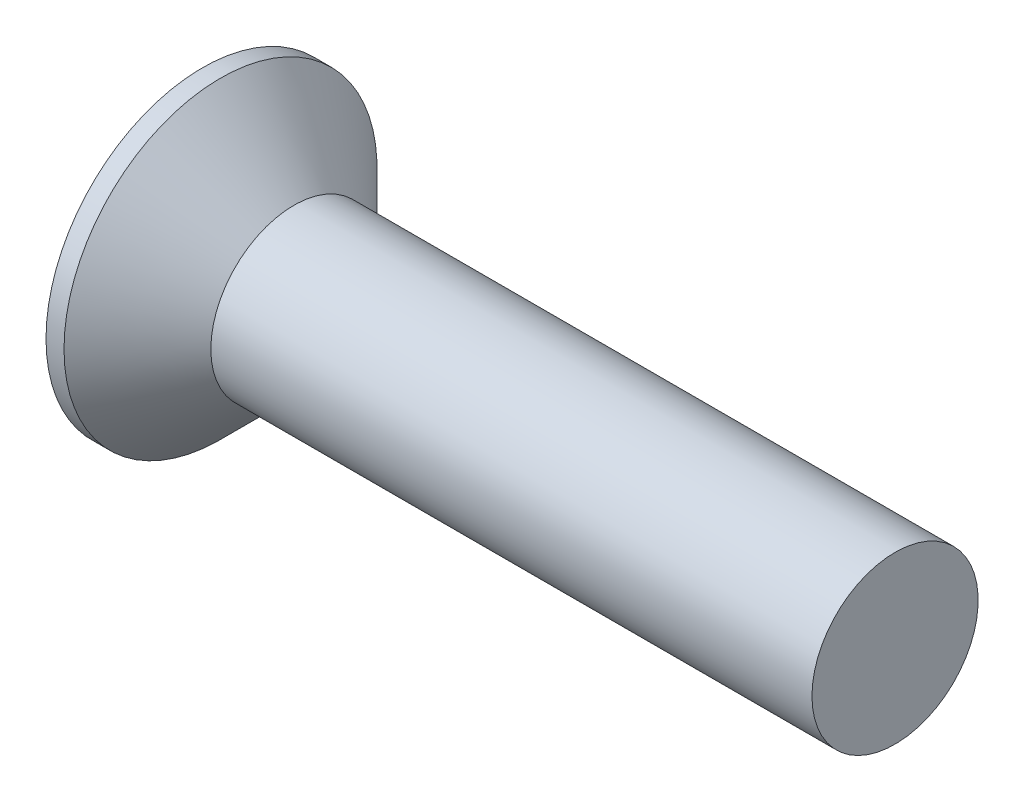
ISO-10303-21;
HEADER;
FILE_DESCRIPTION(('STEP AP214'),'2;1');
FILE_NAME('part.step','',(''),(''),'','','');
FILE_SCHEMA(('AUTOMOTIVE_DESIGN { 1 0 10303 214 1 1 1 1 }'));
ENDSEC;
DATA;
#1=APPLICATION_CONTEXT('core data for automotive mechanical design processes');
#2=APPLICATION_PROTOCOL_DEFINITION('international standard','automotive_design',2000,#1);
#3=PRODUCT_CONTEXT('',#1,'mechanical');
#4=PRODUCT('Part','Part','',(#3));
#5=PRODUCT_RELATED_PRODUCT_CATEGORY('part','',(#4));
#6=PRODUCT_DEFINITION_FORMATION('','',#4);
#7=PRODUCT_DEFINITION_CONTEXT('part definition',#1,'design');
#8=PRODUCT_DEFINITION('design','',#6,#7);
#9=PRODUCT_DEFINITION_SHAPE('','',#8);
#10=(LENGTH_UNIT() NAMED_UNIT(*) SI_UNIT(.MILLI.,.METRE.));
#11=(NAMED_UNIT(*) PLANE_ANGLE_UNIT() SI_UNIT($,.RADIAN.));
#12=(NAMED_UNIT(*) SI_UNIT($,.STERADIAN.) SOLID_ANGLE_UNIT());
#13=UNCERTAINTY_MEASURE_WITH_UNIT(LENGTH_MEASURE(1.E-05),#10,'distance_accuracy_value','');
#14=(GEOMETRIC_REPRESENTATION_CONTEXT(3) GLOBAL_UNCERTAINTY_ASSIGNED_CONTEXT((#13)) GLOBAL_UNIT_ASSIGNED_CONTEXT((#10,
#11,#12)) REPRESENTATION_CONTEXT('',''));
#15=CARTESIAN_POINT('',(0.,0.,0.));
#16=DIRECTION('',(0.,0.,1.));
#17=DIRECTION('',(1.,0.,0.));
#18=AXIS2_PLACEMENT_3D('',#15,#16,#17);
#19=CARTESIAN_POINT('',(0.,0.,0.));
#20=DIRECTION('',(-1.,0.,0.));
#21=DIRECTION('',(0.,0.,1.));
#22=AXIS2_PLACEMENT_3D('',#19,#20,#21);
#23=PLANE('',#22);
#24=CARTESIAN_POINT('',(0.,0.,0.));
#25=DIRECTION('',(-1.,0.,0.));
#26=DIRECTION('',(0.,0.,1.));
#27=AXIS2_PLACEMENT_3D('',#24,#25,#26);
#28=CIRCLE('',#27,5.65);
#29=CARTESIAN_POINT('',(0.,0.,5.65));
#30=VERTEX_POINT('',#29);
#31=EDGE_CURVE('E129',#30,#30,#28,.T.);
#32=ORIENTED_EDGE('',*,*,#31,.T.);
#33=EDGE_LOOP('',(#32));
#34=FACE_BOUND('',#33,.T.);
#35=DIRECTION('',(0.,1.,0.));
#36=VECTOR('',#35,1.);
#37=CARTESIAN_POINT('',(0.,-3.31,-0.56));
#38=LINE('',#37,#36);
#39=CARTESIAN_POINT('',(0.,-3.31,-0.56));
#40=VERTEX_POINT('',#39);
#41=CARTESIAN_POINT('',(0.,-0.559999999999998,-0.56));
#42=VERTEX_POINT('',#41);
#43=EDGE_CURVE('E104',#40,#42,#38,.T.);
#44=ORIENTED_EDGE('',*,*,#43,.T.);
#45=DIRECTION('',(0.,0.,-1.));
#46=VECTOR('',#45,1.);
#47=CARTESIAN_POINT('',(0.,-0.560000000000011,3.31));
#48=LINE('',#47,#46);
#49=CARTESIAN_POINT('',(0.,-0.559999999999989,-3.31));
#50=VERTEX_POINT('',#49);
#51=EDGE_CURVE('E84',#42,#50,#48,.T.);
#52=ORIENTED_EDGE('',*,*,#51,.T.);
#53=DIRECTION('',(0.,1.,0.));
#54=VECTOR('',#53,1.);
#55=CARTESIAN_POINT('',(0.,-0.559999999999989,-3.31));
#56=LINE('',#55,#54);
#57=CARTESIAN_POINT('',(0.,0.560000000000012,-3.31));
#58=VERTEX_POINT('',#57);
#59=EDGE_CURVE('E329',#50,#58,#56,.T.);
#60=ORIENTED_EDGE('',*,*,#59,.T.);
#61=DIRECTION('',(0.,0.,1.));
#62=VECTOR('',#61,1.);
#63=CARTESIAN_POINT('',(0.,0.560000000000012,-3.31));
#64=LINE('',#63,#62);
#65=CARTESIAN_POINT('',(0.,0.560000000000002,-0.56));
#66=VERTEX_POINT('',#65);
#67=EDGE_CURVE('E100',#58,#66,#64,.T.);
#68=ORIENTED_EDGE('',*,*,#67,.T.);
#69=CARTESIAN_POINT('',(0.,3.31,-0.56));
#70=VERTEX_POINT('',#69);
#71=EDGE_CURVE('E94',#66,#70,#38,.T.);
#72=ORIENTED_EDGE('',*,*,#71,.T.);
#73=DIRECTION('',(0.,0.,1.));
#74=VECTOR('',#73,1.);
#75=CARTESIAN_POINT('',(0.,3.31,-0.56));
#76=LINE('',#75,#74);
#77=CARTESIAN_POINT('',(0.,3.31,0.56));
#78=VERTEX_POINT('',#77);
#79=EDGE_CURVE('E97',#70,#78,#76,.T.);
#80=ORIENTED_EDGE('',*,*,#79,.T.);
#81=DIRECTION('',(0.,-1.,0.));
#82=VECTOR('',#81,1.);
#83=CARTESIAN_POINT('',(0.,3.31,0.56));
#84=LINE('',#83,#82);
#85=CARTESIAN_POINT('',(0.,0.559999999999998,0.56));
#86=VERTEX_POINT('',#85);
#87=EDGE_CURVE('E321',#78,#86,#84,.T.);
#88=ORIENTED_EDGE('',*,*,#87,.T.);
#89=CARTESIAN_POINT('',(0.,0.559999999999988,3.31));
#90=VERTEX_POINT('',#89);
#91=EDGE_CURVE('E339',#86,#90,#64,.T.);
#92=ORIENTED_EDGE('',*,*,#91,.T.);
#93=DIRECTION('',(0.,-1.,0.));
#94=VECTOR('',#93,1.);
#95=CARTESIAN_POINT('',(0.,0.559999999999988,3.31));
#96=LINE('',#95,#94);
#97=CARTESIAN_POINT('',(0.,-0.560000000000011,3.31));
#98=VERTEX_POINT('',#97);
#99=EDGE_CURVE('E341',#90,#98,#96,.T.);
#100=ORIENTED_EDGE('',*,*,#99,.T.);
#101=CARTESIAN_POINT('',(0.,-0.560000000000002,0.56));
#102=VERTEX_POINT('',#101);
#103=EDGE_CURVE('E343',#98,#102,#48,.T.);
#104=ORIENTED_EDGE('',*,*,#103,.T.);
#105=CARTESIAN_POINT('',(0.,-3.31,0.56));
#106=VERTEX_POINT('',#105);
#107=EDGE_CURVE('E110',#102,#106,#84,.T.);
#108=ORIENTED_EDGE('',*,*,#107,.T.);
#109=DIRECTION('',(0.,0.,-1.));
#110=VECTOR('',#109,1.);
#111=CARTESIAN_POINT('',(0.,-3.31,0.56));
#112=LINE('',#111,#110);
#113=EDGE_CURVE('E133',#106,#40,#112,.T.);
#114=ORIENTED_EDGE('',*,*,#113,.T.);
#115=EDGE_LOOP('',(#44,#52,#60,#68,#72,#80,#88,#92,#100,#104,#108,#114));
#116=FACE_BOUND('',#115,.T.);
#117=ADVANCED_FACE('F35',(#34,#116),#23,.T.);
#118=CARTESIAN_POINT('',(3.94359735973597,0.,0.254125412541254));
#119=DIRECTION('',(-0.0773300701082969,0.,-0.9970055467534));
#120=DIRECTION('',(-0.9970055467534,0.,0.0773300701082969));
#121=AXIS2_PLACEMENT_3D('',#118,#119,#120);
#122=PLANE('',#121);
#123=ORIENTED_EDGE('',*,*,#107,.F.);
#124=DIRECTION('',(0.994037833653026,0.0770998873747502,-0.07709988737475));
#125=VECTOR('',#124,1.);
#126=CARTESIAN_POINT('',(3.96307358345415,-0.252614791311036,0.252614791311035));
#127=LINE('',#126,#125);
#128=CARTESIAN_POINT('',(3.61,-0.280000000000001,0.279999999999998));
#129=VERTEX_POINT('',#128);
#130=EDGE_CURVE('E128',#102,#129,#127,.T.);
#131=ORIENTED_EDGE('',*,*,#130,.T.);
#132=DIRECTION('',(0.764607457283212,0.641761937830508,-0.0593047335288919));
#133=VECTOR('',#132,1.);
#134=CARTESIAN_POINT('',(0.,-3.31,0.56));
#135=LINE('',#134,#133);
#136=EDGE_CURVE('E105',#106,#129,#135,.T.);
#137=ORIENTED_EDGE('',*,*,#136,.F.);
#138=EDGE_LOOP('',(#123,#131,#137));
#139=FACE_BOUND('',#138,.T.);
#140=ADVANCED_FACE('F153',(#139),#122,.T.);
#141=DIRECTION('',(0.764607457283212,-0.641761937830508,-0.0593047335288917));
#142=VECTOR('',#141,1.);
#143=CARTESIAN_POINT('',(0.,3.31,0.56));
#144=LINE('',#143,#142);
#145=CARTESIAN_POINT('',(3.61,0.279999999999999,0.28));
#146=VERTEX_POINT('',#145);
#147=EDGE_CURVE('E50',#78,#146,#144,.T.);
#148=ORIENTED_EDGE('',*,*,#147,.T.);
#149=DIRECTION('',(-0.994037833653026,0.0770998873747497,0.07709988737475));
#150=VECTOR('',#149,1.);
#151=CARTESIAN_POINT('',(3.96307358345415,0.252614791311034,0.252614791311035));
#152=LINE('',#151,#150);
#153=EDGE_CURVE('E325',#146,#86,#152,.T.);
#154=ORIENTED_EDGE('',*,*,#153,.T.);
#155=ORIENTED_EDGE('',*,*,#87,.F.);
#156=EDGE_LOOP('',(#148,#154,#155));
#157=FACE_BOUND('',#156,.T.);
#158=ADVANCED_FACE('F159',(#157),#122,.T.);
#159=CARTESIAN_POINT('',(3.94359735973597,0.,-0.254125412541254));
#160=DIRECTION('',(-0.0773300701082969,0.,0.9970055467534));
#161=DIRECTION('',(0.9970055467534,0.,0.0773300701082969));
#162=AXIS2_PLACEMENT_3D('',#159,#160,#161);
#163=PLANE('',#162);
#164=DIRECTION('',(0.764607457283212,0.641761937830508,0.0593047335288918));
#165=VECTOR('',#164,1.);
#166=CARTESIAN_POINT('',(0.,-3.31,-0.56));
#167=LINE('',#166,#165);
#168=CARTESIAN_POINT('',(3.61,-0.279999999999999,-0.280000000000001));
#169=VERTEX_POINT('',#168);
#170=EDGE_CURVE('E59',#40,#169,#167,.T.);
#171=ORIENTED_EDGE('',*,*,#170,.T.);
#172=DIRECTION('',(-0.994037833653026,-0.0770998873747497,-0.07709988737475));
#173=VECTOR('',#172,1.);
#174=CARTESIAN_POINT('',(3.96307358345415,-0.252614791311034,-0.252614791311035));
#175=LINE('',#174,#173);
#176=EDGE_CURVE('E11',#169,#42,#175,.T.);
#177=ORIENTED_EDGE('',*,*,#176,.T.);
#178=ORIENTED_EDGE('',*,*,#43,.F.);
#179=EDGE_LOOP('',(#171,#177,#178));
#180=FACE_BOUND('',#179,.T.);
#181=ADVANCED_FACE('F150',(#180),#163,.T.);
#182=ORIENTED_EDGE('',*,*,#71,.F.);
#183=DIRECTION('',(0.994037833653026,-0.0770998873747502,0.07709988737475));
#184=VECTOR('',#183,1.);
#185=CARTESIAN_POINT('',(3.96307358345415,0.252614791311036,-0.252614791311035));
#186=LINE('',#185,#184);
#187=CARTESIAN_POINT('',(3.61,0.28,-0.28));
#188=VERTEX_POINT('',#187);
#189=EDGE_CURVE('E113',#66,#188,#186,.T.);
#190=ORIENTED_EDGE('',*,*,#189,.T.);
#191=DIRECTION('',(0.764607457283212,-0.641761937830508,0.0593047335288918));
#192=VECTOR('',#191,1.);
#193=CARTESIAN_POINT('',(0.,3.31,-0.56));
#194=LINE('',#193,#192);
#195=EDGE_CURVE('E109',#70,#188,#194,.T.);
#196=ORIENTED_EDGE('',*,*,#195,.F.);
#197=EDGE_LOOP('',(#182,#190,#196));
#198=FACE_BOUND('',#197,.T.);
#199=ADVANCED_FACE('F112',(#198),#163,.T.);
#200=CARTESIAN_POINT('',(25.,3.,0.));
#201=DIRECTION('',(1.,0.,0.));
#202=DIRECTION('',(0.,0.,-1.));
#203=AXIS2_PLACEMENT_3D('',#200,#201,#202);
#204=PLANE('',#203);
#205=CARTESIAN_POINT('',(25.,0.,0.));
#206=DIRECTION('',(-1.,0.,0.));
#207=DIRECTION('',(0.,0.,1.));
#208=AXIS2_PLACEMENT_3D('',#205,#206,#207);
#209=CIRCLE('',#208,3.);
#210=CARTESIAN_POINT('',(25.,0.,3.));
#211=VERTEX_POINT('',#210);
#212=EDGE_CURVE('E43',#211,#211,#209,.T.);
#213=ORIENTED_EDGE('',*,*,#212,.F.);
#214=EDGE_LOOP('',(#213));
#215=FACE_BOUND('',#214,.T.);
#216=ADVANCED_FACE('F37',(#215),#204,.T.);
#217=CARTESIAN_POINT('',(-6.34999999999999,0.,0.));
#218=DIRECTION('',(-1.,0.,0.));
#219=DIRECTION('',(0.,0.,1.));
#220=AXIS2_PLACEMENT_3D('',#217,#218,#219);
#221=CYLINDRICAL_SURFACE('',#220,3.);
#222=ORIENTED_EDGE('',*,*,#212,.T.);
#223=EDGE_LOOP('',(#222));
#224=FACE_BOUND('',#223,.T.);
#225=CARTESIAN_POINT('',(3.3,0.,0.));
#226=DIRECTION('',(-1.,0.,0.));
#227=DIRECTION('',(0.,0.,1.));
#228=AXIS2_PLACEMENT_3D('',#225,#226,#227);
#229=CIRCLE('',#228,3.);
#230=CARTESIAN_POINT('',(3.3,0.,3.));
#231=VERTEX_POINT('',#230);
#232=EDGE_CURVE('E136',#231,#231,#229,.T.);
#233=ORIENTED_EDGE('',*,*,#232,.F.);
#234=EDGE_LOOP('',(#233));
#235=FACE_BOUND('',#234,.T.);
#236=ADVANCED_FACE('F141',(#224,#235),#221,.T.);
#237=CARTESIAN_POINT('',(0.65000000000001,0.,0.));
#238=DIRECTION('',(-1.,0.,0.));
#239=DIRECTION('',(0.,0.,1.));
#240=AXIS2_PLACEMENT_3D('',#237,#238,#239);
#241=CONICAL_SURFACE('',#240,5.65,0.78539816339745);
#242=ORIENTED_EDGE('',*,*,#232,.T.);
#243=EDGE_LOOP('',(#242));
#244=FACE_BOUND('',#243,.T.);
#245=CARTESIAN_POINT('',(0.65000000000001,0.,0.));
#246=DIRECTION('',(-1.,0.,0.));
#247=DIRECTION('',(0.,0.,1.));
#248=AXIS2_PLACEMENT_3D('',#245,#246,#247);
#249=CIRCLE('',#248,5.65);
#250=CARTESIAN_POINT('',(0.65000000000001,0.,5.65));
#251=VERTEX_POINT('',#250);
#252=EDGE_CURVE('E132',#251,#251,#249,.T.);
#253=ORIENTED_EDGE('',*,*,#252,.F.);
#254=EDGE_LOOP('',(#253));
#255=FACE_BOUND('',#254,.T.);
#256=ADVANCED_FACE('F149',(#244,#255),#241,.T.);
#257=CARTESIAN_POINT('',(-6.34999999999999,0.,0.));
#258=DIRECTION('',(-1.,0.,0.));
#259=DIRECTION('',(0.,0.,1.));
#260=AXIS2_PLACEMENT_3D('',#257,#258,#259);
#261=CYLINDRICAL_SURFACE('',#260,5.65);
#262=ORIENTED_EDGE('',*,*,#252,.T.);
#263=EDGE_LOOP('',(#262));
#264=FACE_BOUND('',#263,.T.);
#265=ORIENTED_EDGE('',*,*,#31,.F.);
#266=EDGE_LOOP('',(#265));
#267=FACE_BOUND('',#266,.T.);
#268=ADVANCED_FACE('F166',(#264,#267),#261,.T.);
#269=CARTESIAN_POINT('',(3.61,0.28,-0.28));
#270=DIRECTION('',(1.,0.,0.));
#271=DIRECTION('',(0.,0.,-1.));
#272=AXIS2_PLACEMENT_3D('',#269,#270,#271);
#273=PLANE('',#272);
#274=DIRECTION('',(0.,1.,0.));
#275=VECTOR('',#274,1.);
#276=CARTESIAN_POINT('',(3.61,-0.28,-0.28));
#277=LINE('',#276,#275);
#278=EDGE_CURVE('E124',#169,#188,#277,.T.);
#279=ORIENTED_EDGE('',*,*,#278,.F.);
#280=DIRECTION('',(0.,0.,-1.));
#281=VECTOR('',#280,1.);
#282=CARTESIAN_POINT('',(3.61,-0.28,0.28));
#283=LINE('',#282,#281);
#284=EDGE_CURVE('E115',#129,#169,#283,.T.);
#285=ORIENTED_EDGE('',*,*,#284,.F.);
#286=DIRECTION('',(0.,-1.,0.));
#287=VECTOR('',#286,1.);
#288=CARTESIAN_POINT('',(3.61,0.28,0.28));
#289=LINE('',#288,#287);
#290=EDGE_CURVE('E118',#146,#129,#289,.T.);
#291=ORIENTED_EDGE('',*,*,#290,.F.);
#292=DIRECTION('',(0.,0.,1.));
#293=VECTOR('',#292,1.);
#294=CARTESIAN_POINT('',(3.61,0.28,-0.28));
#295=LINE('',#294,#293);
#296=EDGE_CURVE('E122',#188,#146,#295,.T.);
#297=ORIENTED_EDGE('',*,*,#296,.F.);
#298=EDGE_LOOP('',(#279,#285,#291,#297));
#299=FACE_BOUND('',#298,.T.);
#300=ADVANCED_FACE('F164',(#299),#273,.F.);
#301=CARTESIAN_POINT('',(0.,-3.31,-0.56));
#302=DIRECTION('',(-0.642893478338491,0.765955596304274,0.));
#303=DIRECTION('',(-0.765955596304275,-0.642893478338491,0.));
#304=AXIS2_PLACEMENT_3D('',#301,#302,#303);
#305=PLANE('',#304);
#306=ORIENTED_EDGE('',*,*,#170,.F.);
#307=ORIENTED_EDGE('',*,*,#113,.F.);
#308=ORIENTED_EDGE('',*,*,#136,.T.);
#309=ORIENTED_EDGE('',*,*,#284,.T.);
#310=EDGE_LOOP('',(#306,#307,#308,#309));
#311=FACE_BOUND('',#310,.T.);
#312=ADVANCED_FACE('F192',(#311),#305,.T.);
#313=CARTESIAN_POINT('',(0.,3.31,0.559999999999999));
#314=DIRECTION('',(-0.642893478338491,-0.765955596304274,0.));
#315=DIRECTION('',(0.765955596304274,-0.642893478338491,0.));
#316=AXIS2_PLACEMENT_3D('',#313,#314,#315);
#317=PLANE('',#316);
#318=ORIENTED_EDGE('',*,*,#147,.F.);
#319=ORIENTED_EDGE('',*,*,#79,.F.);
#320=ORIENTED_EDGE('',*,*,#195,.T.);
#321=ORIENTED_EDGE('',*,*,#296,.T.);
#322=EDGE_LOOP('',(#318,#319,#320,#321));
#323=FACE_BOUND('',#322,.T.);
#324=ADVANCED_FACE('F108',(#323),#317,.T.);
#325=CARTESIAN_POINT('',(3.94359735973597,-0.254125412541254,0.));
#326=DIRECTION('',(-0.0773300701082969,0.9970055467534,0.));
#327=DIRECTION('',(-0.9970055467534,-0.0773300701082969,0.));
#328=AXIS2_PLACEMENT_3D('',#325,#326,#327);
#329=PLANE('',#328);
#330=DIRECTION('',(0.764607457283212,0.0593047335288896,0.641761937830508));
#331=VECTOR('',#330,1.);
#332=CARTESIAN_POINT('',(0.,-0.559999999999989,-3.31));
#333=LINE('',#332,#331);
#334=EDGE_CURVE('E336',#50,#169,#333,.T.);
#335=ORIENTED_EDGE('',*,*,#334,.F.);
#336=ORIENTED_EDGE('',*,*,#51,.F.);
#337=ORIENTED_EDGE('',*,*,#176,.F.);
#338=EDGE_LOOP('',(#335,#336,#337));
#339=FACE_BOUND('',#338,.T.);
#340=ADVANCED_FACE('F206',(#339),#329,.T.);
#341=CARTESIAN_POINT('',(3.94359735973597,0.254125412541254,0.));
#342=DIRECTION('',(-0.0773300701082969,-0.9970055467534,0.));
#343=DIRECTION('',(0.9970055467534,-0.0773300701082969,0.));
#344=AXIS2_PLACEMENT_3D('',#341,#342,#343);
#345=PLANE('',#344);
#346=ORIENTED_EDGE('',*,*,#67,.F.);
#347=DIRECTION('',(0.764607457283212,-0.059304733528894,0.641761937830507));
#348=VECTOR('',#347,1.);
#349=CARTESIAN_POINT('',(0.,0.560000000000012,-3.31));
#350=LINE('',#349,#348);
#351=EDGE_CURVE('E75',#58,#188,#350,.T.);
#352=ORIENTED_EDGE('',*,*,#351,.T.);
#353=ORIENTED_EDGE('',*,*,#189,.F.);
#354=EDGE_LOOP('',(#346,#352,#353));
#355=FACE_BOUND('',#354,.T.);
#356=ADVANCED_FACE('F212',(#355),#345,.T.);
#357=CARTESIAN_POINT('',(0.,0.560000000000011,-3.31));
#358=DIRECTION('',(-0.642893478338491,0.,0.765955596304274));
#359=DIRECTION('',(-0.765955596304275,0.,-0.642893478338491));
#360=AXIS2_PLACEMENT_3D('',#357,#358,#359);
#361=PLANE('',#360);
#362=ORIENTED_EDGE('',*,*,#351,.F.);
#363=ORIENTED_EDGE('',*,*,#59,.F.);
#364=ORIENTED_EDGE('',*,*,#334,.T.);
#365=ORIENTED_EDGE('',*,*,#278,.T.);
#366=EDGE_LOOP('',(#362,#363,#364,#365));
#367=FACE_BOUND('',#366,.T.);
#368=ADVANCED_FACE('F220',(#367),#361,.T.);
#369=ORIENTED_EDGE('',*,*,#103,.F.);
#370=DIRECTION('',(0.764607457283212,0.0593047335288939,-0.641761937830508));
#371=VECTOR('',#370,1.);
#372=CARTESIAN_POINT('',(0.,-0.560000000000011,3.31));
#373=LINE('',#372,#371);
#374=EDGE_CURVE('E332',#98,#129,#373,.T.);
#375=ORIENTED_EDGE('',*,*,#374,.T.);
#376=ORIENTED_EDGE('',*,*,#130,.F.);
#377=EDGE_LOOP('',(#369,#375,#376));
#378=FACE_BOUND('',#377,.T.);
#379=ADVANCED_FACE('F214',(#378),#329,.T.);
#380=DIRECTION('',(0.764607457283212,-0.0593047335288895,-0.641761937830508));
#381=VECTOR('',#380,1.);
#382=CARTESIAN_POINT('',(0.,0.559999999999988,3.31));
#383=LINE('',#382,#381);
#384=EDGE_CURVE('E330',#90,#146,#383,.T.);
#385=ORIENTED_EDGE('',*,*,#384,.F.);
#386=ORIENTED_EDGE('',*,*,#91,.F.);
#387=ORIENTED_EDGE('',*,*,#153,.F.);
#388=EDGE_LOOP('',(#385,#386,#387));
#389=FACE_BOUND('',#388,.T.);
#390=ADVANCED_FACE('F222',(#389),#345,.T.);
#391=CARTESIAN_POINT('',(0.,-0.560000000000011,3.31));
#392=DIRECTION('',(-0.642893478338491,0.,-0.765955596304274));
#393=DIRECTION('',(0.765955596304274,0.,-0.642893478338491));
#394=AXIS2_PLACEMENT_3D('',#391,#392,#393);
#395=PLANE('',#394);
#396=ORIENTED_EDGE('',*,*,#374,.F.);
#397=ORIENTED_EDGE('',*,*,#99,.F.);
#398=ORIENTED_EDGE('',*,*,#384,.T.);
#399=ORIENTED_EDGE('',*,*,#290,.T.);
#400=EDGE_LOOP('',(#396,#397,#398,#399));
#401=FACE_BOUND('',#400,.T.);
#402=ADVANCED_FACE('F241',(#401),#395,.T.);
#403=CLOSED_SHELL('',(#117,#140,#158,#181,#199,#216,#236,#256,#268,#300,#312,#324,#340,#356,
#368,#379,#390,#402));
#404=MANIFOLD_SOLID_BREP('B2',#403);
#405=ADVANCED_BREP_SHAPE_REPRESENTATION('',(#18,#404),#14);
#406=SHAPE_DEFINITION_REPRESENTATION(#9,#405);
ENDSEC;
END-ISO-10303-21;
